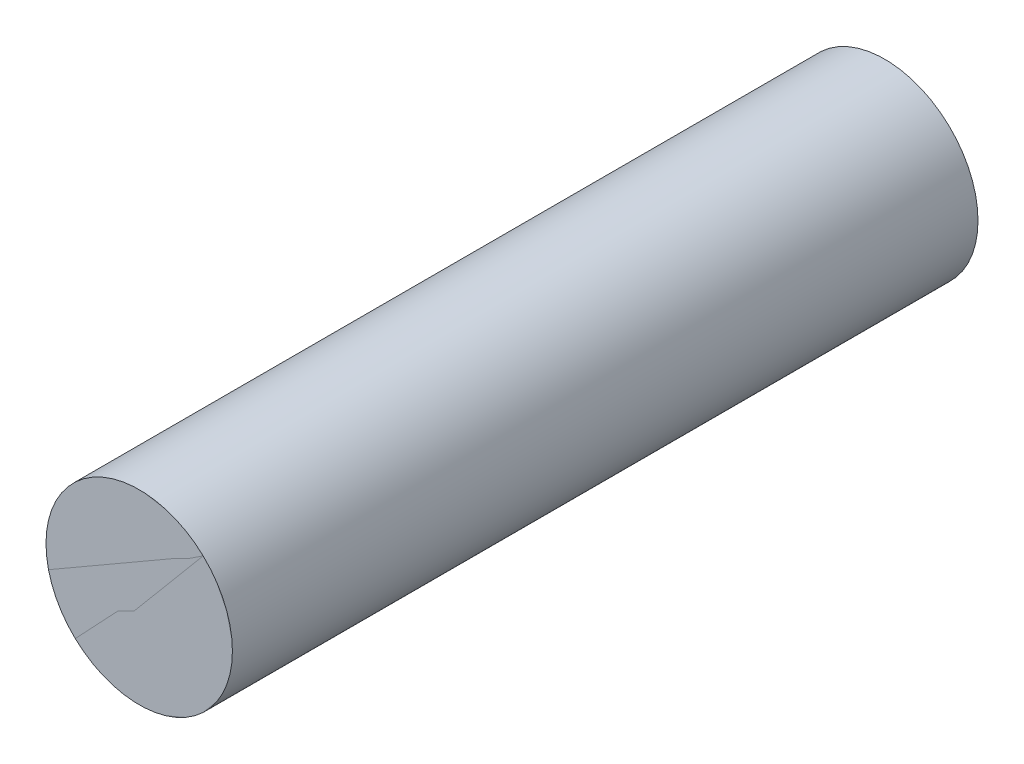
ISO-10303-21;
HEADER;
FILE_DESCRIPTION(('STEP AP214'),'2;1');
FILE_NAME('part.step','',(''),(''),'','','');
FILE_SCHEMA(('AUTOMOTIVE_DESIGN { 1 0 10303 214 1 1 1 1 }'));
ENDSEC;
DATA;
#1=APPLICATION_CONTEXT('core data for automotive mechanical design processes');
#2=APPLICATION_PROTOCOL_DEFINITION('international standard','automotive_design',2000,#1);
#3=PRODUCT_CONTEXT('',#1,'mechanical');
#4=PRODUCT('Part','Part','',(#3));
#5=PRODUCT_RELATED_PRODUCT_CATEGORY('part','',(#4));
#6=PRODUCT_DEFINITION_FORMATION('','',#4);
#7=PRODUCT_DEFINITION_CONTEXT('part definition',#1,'design');
#8=PRODUCT_DEFINITION('design','',#6,#7);
#9=PRODUCT_DEFINITION_SHAPE('','',#8);
#10=(LENGTH_UNIT() NAMED_UNIT(*) SI_UNIT(.MILLI.,.METRE.));
#11=(NAMED_UNIT(*) PLANE_ANGLE_UNIT() SI_UNIT($,.RADIAN.));
#12=(NAMED_UNIT(*) SI_UNIT($,.STERADIAN.) SOLID_ANGLE_UNIT());
#13=UNCERTAINTY_MEASURE_WITH_UNIT(LENGTH_MEASURE(1.E-05),#10,'distance_accuracy_value','');
#14=(GEOMETRIC_REPRESENTATION_CONTEXT(3) GLOBAL_UNCERTAINTY_ASSIGNED_CONTEXT((#13)) GLOBAL_UNIT_ASSIGNED_CONTEXT((#10,
#11,#12)) REPRESENTATION_CONTEXT('',''));
#15=CARTESIAN_POINT('',(0.,0.,0.));
#16=DIRECTION('',(0.,0.,1.));
#17=DIRECTION('',(1.,0.,0.));
#18=AXIS2_PLACEMENT_3D('',#15,#16,#17);
#19=CARTESIAN_POINT('',(-75.4181941684056,-40.4144186635382,-5.29999999999908));
#20=DIRECTION('',(0.,0.,1.));
#21=DIRECTION('',(1.,0.,0.));
#22=AXIS2_PLACEMENT_3D('',#19,#20,#21);
#23=CYLINDRICAL_SURFACE('',#22,0.225000000000002);
#24=CARTESIAN_POINT('',(-75.4181941684056,-40.4144186635382,-5.29999999999908));
#25=DIRECTION('',(0.,0.,1.));
#26=DIRECTION('',(1.,0.,0.));
#27=AXIS2_PLACEMENT_3D('',#24,#25,#26);
#28=CIRCLE('',#27,0.225000000000002);
#29=CARTESIAN_POINT('',(-75.1931941684056,-40.4144186635382,-5.29999999999908));
#30=VERTEX_POINT('',#29);
#31=EDGE_CURVE('E11',#30,#30,#28,.T.);
#32=ORIENTED_EDGE('',*,*,#31,.T.);
#33=EDGE_LOOP('',(#32));
#34=FACE_BOUND('',#33,.T.);
#35=CARTESIAN_POINT('',(-75.4181941684056,-40.4144186635382,-3.49999999999908));
#36=DIRECTION('',(0.,0.,1.));
#37=DIRECTION('',(1.,0.,0.));
#38=AXIS2_PLACEMENT_3D('',#35,#36,#37);
#39=CIRCLE('',#38,0.225000000000002);
#40=CARTESIAN_POINT('',(-75.1931941684056,-40.4144186635382,-3.49999999999908));
#41=VERTEX_POINT('',#40);
#42=EDGE_CURVE('E46',#41,#41,#39,.T.);
#43=ORIENTED_EDGE('',*,*,#42,.F.);
#44=EDGE_LOOP('',(#43));
#45=FACE_BOUND('',#44,.T.);
#46=ADVANCED_FACE('F43',(#34,#45),#23,.T.);
#47=CARTESIAN_POINT('',(-75.4181941684056,-40.4144186635382,-5.29999999999908));
#48=DIRECTION('',(0.,0.,1.));
#49=DIRECTION('',(1.,0.,0.));
#50=AXIS2_PLACEMENT_3D('',#47,#48,#49);
#51=PLANE('',#50);
#52=ORIENTED_EDGE('',*,*,#31,.F.);
#53=EDGE_LOOP('',(#52));
#54=FACE_BOUND('',#53,.T.);
#55=ADVANCED_FACE('F58',(#54),#51,.F.);
#56=CARTESIAN_POINT('',(-75.4181941684056,-40.4144186635382,-3.49999999999908));
#57=DIRECTION('',(0.,0.,1.));
#58=DIRECTION('',(1.,0.,0.));
#59=AXIS2_PLACEMENT_3D('',#56,#57,#58);
#60=PLANE('',#59);
#61=ORIENTED_EDGE('',*,*,#42,.T.);
#62=EDGE_LOOP('',(#61));
#63=FACE_BOUND('',#62,.T.);
#64=ADVANCED_FACE('F55',(#63),#60,.T.);
#65=CLOSED_SHELL('',(#46,#55,#64));
#66=MANIFOLD_SOLID_BREP('B2',#65);
#67=CARTESIAN_POINT('',(-75.4181941684056,-40.4144186635382,-3.49999999999908));
#68=DIRECTION('',(0.,0.,1.));
#69=DIRECTION('',(1.,0.,0.));
#70=AXIS2_PLACEMENT_3D('',#67,#68,#69);
#71=PLANE('',#70);
#72=CARTESIAN_POINT('',(-75.4181941684056,-40.4144186635382,-3.49999999999908));
#73=DIRECTION('',(0.,0.,1.));
#74=DIRECTION('',(1.,0.,0.));
#75=AXIS2_PLACEMENT_3D('',#72,#73,#74);
#76=CIRCLE('',#75,0.225000000000003);
#77=CARTESIAN_POINT('',(-75.1931941684056,-40.4144186635382,-3.49999999999908));
#78=VERTEX_POINT('',#77);
#79=EDGE_CURVE('E42',#78,#78,#76,.F.);
#80=ORIENTED_EDGE('',*,*,#79,.F.);
#81=EDGE_LOOP('',(#80));
#82=FACE_BOUND('',#81,.T.);
#83=ADVANCED_FACE('F83',(#82),#71,.T.);
#84=OPEN_SHELL('',(#83));
#85=SHELL_BASED_SURFACE_MODEL('B6',(#84));
#86=ADVANCED_BREP_SHAPE_REPRESENTATION('',(#18,#66),#14);
#87=MANIFOLD_SURFACE_SHAPE_REPRESENTATION('',(#18,#85),#14);
#88=SHAPE_REPRESENTATION('',(#18),#14);
#89=SHAPE_DEFINITION_REPRESENTATION(#9,#88);
#90=SHAPE_REPRESENTATION_RELATIONSHIP('','',#88,#86);
#91=SHAPE_REPRESENTATION_RELATIONSHIP('','',#88,#87);
ENDSEC;
END-ISO-10303-21;
